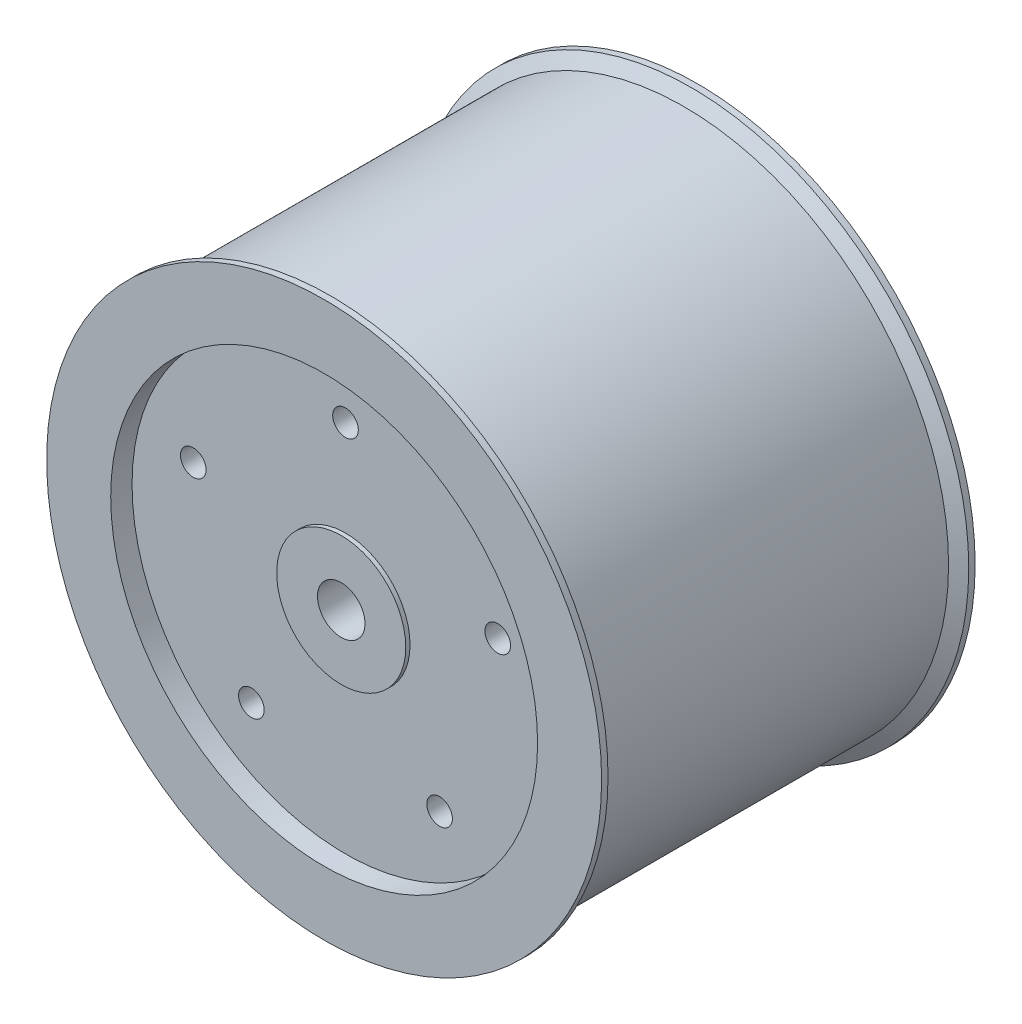
ISO-10303-21;
HEADER;
FILE_DESCRIPTION(('STEP AP214'),'2;1');
FILE_NAME('part.step','',(''),(''),'','','');
FILE_SCHEMA(('AUTOMOTIVE_DESIGN { 1 0 10303 214 1 1 1 1 }'));
ENDSEC;
DATA;
#1=APPLICATION_CONTEXT('core data for automotive mechanical design processes');
#2=APPLICATION_PROTOCOL_DEFINITION('international standard','automotive_design',2000,#1);
#3=PRODUCT_CONTEXT('',#1,'mechanical');
#4=PRODUCT('Part','Part','',(#3));
#5=PRODUCT_RELATED_PRODUCT_CATEGORY('part','',(#4));
#6=PRODUCT_DEFINITION_FORMATION('','',#4);
#7=PRODUCT_DEFINITION_CONTEXT('part definition',#1,'design');
#8=PRODUCT_DEFINITION('design','',#6,#7);
#9=PRODUCT_DEFINITION_SHAPE('','',#8);
#10=(LENGTH_UNIT() NAMED_UNIT(*) SI_UNIT(.MILLI.,.METRE.));
#11=(NAMED_UNIT(*) PLANE_ANGLE_UNIT() SI_UNIT($,.RADIAN.));
#12=(NAMED_UNIT(*) SI_UNIT($,.STERADIAN.) SOLID_ANGLE_UNIT());
#13=UNCERTAINTY_MEASURE_WITH_UNIT(LENGTH_MEASURE(1.E-05),#10,'distance_accuracy_value','');
#14=(GEOMETRIC_REPRESENTATION_CONTEXT(3) GLOBAL_UNCERTAINTY_ASSIGNED_CONTEXT((#13)) GLOBAL_UNIT_ASSIGNED_CONTEXT((#10,
#11,#12)) REPRESENTATION_CONTEXT('',''));
#15=CARTESIAN_POINT('',(0.,0.,0.));
#16=DIRECTION('',(0.,0.,1.));
#17=DIRECTION('',(1.,0.,0.));
#18=AXIS2_PLACEMENT_3D('',#15,#16,#17);
#19=CARTESIAN_POINT('',(0.,0.,87.5));
#20=DIRECTION('',(0.,0.,-1.));
#21=DIRECTION('',(-1.,0.,0.));
#22=AXIS2_PLACEMENT_3D('',#19,#20,#21);
#23=CYLINDRICAL_SURFACE('',#22,130.);
#24=CARTESIAN_POINT('',(0.,0.,-84.5));
#25=DIRECTION('',(0.,0.,1.));
#26=DIRECTION('',(1.,0.,0.));
#27=AXIS2_PLACEMENT_3D('',#24,#25,#26);
#28=CIRCLE('',#27,130.);
#29=CARTESIAN_POINT('',(130.,0.,-84.5));
#30=VERTEX_POINT('',#29);
#31=EDGE_CURVE('E144',#30,#30,#28,.T.);
#32=ORIENTED_EDGE('',*,*,#31,.F.);
#33=EDGE_LOOP('',(#32));
#34=FACE_BOUND('',#33,.T.);
#35=CARTESIAN_POINT('',(0.,0.,-87.5));
#36=DIRECTION('',(0.,0.,1.));
#37=DIRECTION('',(1.,0.,0.));
#38=AXIS2_PLACEMENT_3D('',#35,#36,#37);
#39=CIRCLE('',#38,130.);
#40=CARTESIAN_POINT('',(130.,0.,-87.5));
#41=VERTEX_POINT('',#40);
#42=EDGE_CURVE('E44',#41,#41,#39,.T.);
#43=ORIENTED_EDGE('',*,*,#42,.T.);
#44=EDGE_LOOP('',(#43));
#45=FACE_BOUND('',#44,.T.);
#46=ADVANCED_FACE('F33',(#34,#45),#23,.T.);
#47=CARTESIAN_POINT('',(0.,0.,87.5));
#48=DIRECTION('',(0.,0.,-1.));
#49=DIRECTION('',(-1.,0.,0.));
#50=AXIS2_PLACEMENT_3D('',#47,#48,#49);
#51=CYLINDRICAL_SURFACE('',#50,11.1125);
#52=CARTESIAN_POINT('',(0.,0.,79.5));
#53=DIRECTION('',(0.,0.,1.));
#54=DIRECTION('',(1.,0.,0.));
#55=AXIS2_PLACEMENT_3D('',#52,#53,#54);
#56=CIRCLE('',#55,11.1125);
#57=CARTESIAN_POINT('',(11.1125,0.,79.5));
#58=VERTEX_POINT('',#57);
#59=EDGE_CURVE('E147',#58,#58,#56,.T.);
#60=ORIENTED_EDGE('',*,*,#59,.T.);
#61=EDGE_LOOP('',(#60));
#62=FACE_BOUND('',#61,.T.);
#63=CARTESIAN_POINT('',(0.,0.,-77.5));
#64=DIRECTION('',(0.,0.,-1.));
#65=DIRECTION('',(-1.,0.,0.));
#66=AXIS2_PLACEMENT_3D('',#63,#64,#65);
#67=CIRCLE('',#66,11.1125);
#68=CARTESIAN_POINT('',(-11.1125,0.,-77.5));
#69=VERTEX_POINT('',#68);
#70=EDGE_CURVE('E55',#69,#69,#67,.T.);
#71=ORIENTED_EDGE('',*,*,#70,.T.);
#72=EDGE_LOOP('',(#71));
#73=FACE_BOUND('',#72,.T.);
#74=ADVANCED_FACE('F108',(#62,#73),#51,.F.);
#75=CARTESIAN_POINT('',(0.,0.,87.5));
#76=DIRECTION('',(0.,0.,1.));
#77=DIRECTION('',(1.,0.,0.));
#78=AXIS2_PLACEMENT_3D('',#75,#76,#77);
#79=PLANE('',#78);
#80=CARTESIAN_POINT('',(0.,0.,87.5));
#81=DIRECTION('',(0.,0.,1.));
#82=DIRECTION('',(1.,0.,0.));
#83=AXIS2_PLACEMENT_3D('',#80,#81,#82);
#84=CIRCLE('',#83,100.);
#85=CARTESIAN_POINT('',(100.,0.,87.5));
#86=VERTEX_POINT('',#85);
#87=EDGE_CURVE('E52',#86,#86,#84,.T.);
#88=ORIENTED_EDGE('',*,*,#87,.F.);
#89=EDGE_LOOP('',(#88));
#90=FACE_BOUND('',#89,.T.);
#91=CARTESIAN_POINT('',(0.,0.,87.5));
#92=DIRECTION('',(0.,0.,1.));
#93=DIRECTION('',(1.,0.,0.));
#94=AXIS2_PLACEMENT_3D('',#91,#92,#93);
#95=CIRCLE('',#94,130.);
#96=CARTESIAN_POINT('',(130.,0.,87.5));
#97=VERTEX_POINT('',#96);
#98=EDGE_CURVE('E40',#97,#97,#95,.T.);
#99=ORIENTED_EDGE('',*,*,#98,.T.);
#100=EDGE_LOOP('',(#99));
#101=FACE_BOUND('',#100,.T.);
#102=ADVANCED_FACE('F105',(#90,#101),#79,.T.);
#103=CARTESIAN_POINT('',(0.,0.,-87.5));
#104=DIRECTION('',(0.,0.,1.));
#105=DIRECTION('',(1.,0.,0.));
#106=AXIS2_PLACEMENT_3D('',#103,#104,#105);
#107=PLANE('',#106);
#108=CARTESIAN_POINT('',(0.,0.,-87.5));
#109=DIRECTION('',(0.,0.,1.));
#110=DIRECTION('',(1.,0.,0.));
#111=AXIS2_PLACEMENT_3D('',#108,#109,#110);
#112=CIRCLE('',#111,100.);
#113=CARTESIAN_POINT('',(100.,0.,-87.5));
#114=VERTEX_POINT('',#113);
#115=EDGE_CURVE('E93',#114,#114,#112,.T.);
#116=ORIENTED_EDGE('',*,*,#115,.T.);
#117=EDGE_LOOP('',(#116));
#118=FACE_BOUND('',#117,.T.);
#119=ORIENTED_EDGE('',*,*,#42,.F.);
#120=EDGE_LOOP('',(#119));
#121=FACE_BOUND('',#120,.T.);
#122=ADVANCED_FACE('F107',(#118,#121),#107,.F.);
#123=CARTESIAN_POINT('',(0.,0.,84.5));
#124=DIRECTION('',(0.,0.,1.));
#125=DIRECTION('',(1.,0.,0.));
#126=AXIS2_PLACEMENT_3D('',#123,#124,#125);
#127=CIRCLE('',#126,130.);
#128=CARTESIAN_POINT('',(130.,0.,84.5));
#129=VERTEX_POINT('',#128);
#130=EDGE_CURVE('E134',#129,#129,#127,.T.);
#131=ORIENTED_EDGE('',*,*,#130,.T.);
#132=EDGE_LOOP('',(#131));
#133=FACE_BOUND('',#132,.T.);
#134=ORIENTED_EDGE('',*,*,#98,.F.);
#135=EDGE_LOOP('',(#134));
#136=FACE_BOUND('',#135,.T.);
#137=ADVANCED_FACE('F35',(#133,#136),#23,.T.);
#138=CARTESIAN_POINT('',(0.,0.,77.5));
#139=DIRECTION('',(0.,0.,1.));
#140=DIRECTION('',(1.,0.,0.));
#141=AXIS2_PLACEMENT_3D('',#138,#139,#140);
#142=CYLINDRICAL_SURFACE('',#141,100.);
#143=CARTESIAN_POINT('',(0.,0.,77.5));
#144=DIRECTION('',(0.,0.,1.));
#145=DIRECTION('',(1.,0.,0.));
#146=AXIS2_PLACEMENT_3D('',#143,#144,#145);
#147=CIRCLE('',#146,100.);
#148=CARTESIAN_POINT('',(100.,0.,77.5));
#149=VERTEX_POINT('',#148);
#150=EDGE_CURVE('E49',#149,#149,#147,.T.);
#151=ORIENTED_EDGE('',*,*,#150,.F.);
#152=EDGE_LOOP('',(#151));
#153=FACE_BOUND('',#152,.T.);
#154=ORIENTED_EDGE('',*,*,#87,.T.);
#155=EDGE_LOOP('',(#154));
#156=FACE_BOUND('',#155,.T.);
#157=ADVANCED_FACE('F103',(#153,#156),#142,.F.);
#158=CARTESIAN_POINT('',(0.,0.,77.5));
#159=DIRECTION('',(0.,0.,1.));
#160=DIRECTION('',(1.,0.,0.));
#161=AXIS2_PLACEMENT_3D('',#158,#159,#160);
#162=PLANE('',#161);
#163=CARTESIAN_POINT('',(0.,0.,77.5));
#164=DIRECTION('',(0.,0.,1.));
#165=DIRECTION('',(1.,0.,0.));
#166=AXIS2_PLACEMENT_3D('',#163,#164,#165);
#167=CIRCLE('',#166,30.2387);
#168=CARTESIAN_POINT('',(30.2387,0.,77.5));
#169=VERTEX_POINT('',#168);
#170=EDGE_CURVE('E10',#169,#169,#167,.T.);
#171=ORIENTED_EDGE('',*,*,#170,.F.);
#172=EDGE_LOOP('',(#171));
#173=FACE_BOUND('',#172,.T.);
#174=CARTESIAN_POINT('',(-44.0838939219351,-60.6762745781213,77.5));
#175=DIRECTION('',(0.,0.,1.));
#176=DIRECTION('',(1.,0.,0.));
#177=AXIS2_PLACEMENT_3D('',#174,#175,#176);
#178=CIRCLE('',#177,6.);
#179=CARTESIAN_POINT('',(-38.0838939219351,-60.6762745781213,77.5));
#180=VERTEX_POINT('',#179);
#181=EDGE_CURVE('E67',#180,#180,#178,.T.);
#182=ORIENTED_EDGE('',*,*,#181,.F.);
#183=EDGE_LOOP('',(#182));
#184=FACE_BOUND('',#183,.T.);
#185=CARTESIAN_POINT('',(44.083893921936,-60.6762745781207,77.5));
#186=DIRECTION('',(0.,0.,1.));
#187=DIRECTION('',(1.,0.,0.));
#188=AXIS2_PLACEMENT_3D('',#185,#186,#187);
#189=CIRCLE('',#188,6.);
#190=CARTESIAN_POINT('',(50.083893921936,-60.6762745781207,77.5));
#191=VERTEX_POINT('',#190);
#192=EDGE_CURVE('E75',#191,#191,#189,.T.);
#193=ORIENTED_EDGE('',*,*,#192,.F.);
#194=EDGE_LOOP('',(#193));
#195=FACE_BOUND('',#194,.T.);
#196=CARTESIAN_POINT('',(71.3292387221363,23.1762745781219,77.5));
#197=DIRECTION('',(0.,0.,1.));
#198=DIRECTION('',(1.,0.,0.));
#199=AXIS2_PLACEMENT_3D('',#196,#197,#198);
#200=CIRCLE('',#199,6.);
#201=CARTESIAN_POINT('',(77.3292387221363,23.1762745781219,77.5));
#202=VERTEX_POINT('',#201);
#203=EDGE_CURVE('E71',#202,#202,#200,.T.);
#204=ORIENTED_EDGE('',*,*,#203,.F.);
#205=EDGE_LOOP('',(#204));
#206=FACE_BOUND('',#205,.T.);
#207=CARTESIAN_POINT('',(-71.3292387221366,23.1762745781209,77.5));
#208=DIRECTION('',(0.,0.,1.));
#209=DIRECTION('',(1.,0.,0.));
#210=AXIS2_PLACEMENT_3D('',#207,#208,#209);
#211=CIRCLE('',#210,6.);
#212=CARTESIAN_POINT('',(-65.3292387221366,23.1762745781209,77.5));
#213=VERTEX_POINT('',#212);
#214=EDGE_CURVE('E63',#213,#213,#211,.T.);
#215=ORIENTED_EDGE('',*,*,#214,.F.);
#216=EDGE_LOOP('',(#215));
#217=FACE_BOUND('',#216,.T.);
#218=CARTESIAN_POINT('',(0.,75.,77.5));
#219=DIRECTION('',(0.,0.,1.));
#220=DIRECTION('',(1.,0.,0.));
#221=AXIS2_PLACEMENT_3D('',#218,#219,#220);
#222=CIRCLE('',#221,6.);
#223=CARTESIAN_POINT('',(6.,75.,77.5));
#224=VERTEX_POINT('',#223);
#225=EDGE_CURVE('E62',#224,#224,#222,.T.);
#226=ORIENTED_EDGE('',*,*,#225,.F.);
#227=EDGE_LOOP('',(#226));
#228=FACE_BOUND('',#227,.T.);
#229=ORIENTED_EDGE('',*,*,#150,.T.);
#230=EDGE_LOOP('',(#229));
#231=FACE_BOUND('',#230,.T.);
#232=ADVANCED_FACE('F128',(#173,#184,#195,#206,#217,#228,#231),#162,.T.);
#233=CARTESIAN_POINT('',(0.,0.,-77.5));
#234=DIRECTION('',(0.,0.,-1.));
#235=DIRECTION('',(-1.,0.,0.));
#236=AXIS2_PLACEMENT_3D('',#233,#234,#235);
#237=CYLINDRICAL_SURFACE('',#236,100.);
#238=CARTESIAN_POINT('',(0.,0.,-77.5));
#239=DIRECTION('',(0.,0.,1.));
#240=DIRECTION('',(1.,0.,0.));
#241=AXIS2_PLACEMENT_3D('',#238,#239,#240);
#242=CIRCLE('',#241,100.);
#243=CARTESIAN_POINT('',(100.,0.,-77.5));
#244=VERTEX_POINT('',#243);
#245=EDGE_CURVE('E58',#244,#244,#242,.T.);
#246=ORIENTED_EDGE('',*,*,#245,.T.);
#247=EDGE_LOOP('',(#246));
#248=FACE_BOUND('',#247,.T.);
#249=ORIENTED_EDGE('',*,*,#115,.F.);
#250=EDGE_LOOP('',(#249));
#251=FACE_BOUND('',#250,.T.);
#252=ADVANCED_FACE('F187',(#248,#251),#237,.F.);
#253=CARTESIAN_POINT('',(0.,0.,-77.5));
#254=DIRECTION('',(0.,0.,-1.));
#255=DIRECTION('',(1.,0.,0.));
#256=AXIS2_PLACEMENT_3D('',#253,#254,#255);
#257=PLANE('',#256);
#258=CARTESIAN_POINT('',(-44.0838939219351,-60.6762745781213,-77.5));
#259=DIRECTION('',(0.,0.,-1.));
#260=DIRECTION('',(-1.,0.,0.));
#261=AXIS2_PLACEMENT_3D('',#258,#259,#260);
#262=CIRCLE('',#261,6.);
#263=CARTESIAN_POINT('',(-50.0838939219352,-60.6762745781213,-77.5));
#264=VERTEX_POINT('',#263);
#265=EDGE_CURVE('E76',#264,#264,#262,.T.);
#266=ORIENTED_EDGE('',*,*,#265,.F.);
#267=EDGE_LOOP('',(#266));
#268=FACE_BOUND('',#267,.T.);
#269=CARTESIAN_POINT('',(44.083893921936,-60.6762745781207,-77.5));
#270=DIRECTION('',(0.,0.,-1.));
#271=DIRECTION('',(-1.,0.,0.));
#272=AXIS2_PLACEMENT_3D('',#269,#270,#271);
#273=CIRCLE('',#272,6.);
#274=CARTESIAN_POINT('',(38.083893921936,-60.6762745781207,-77.5));
#275=VERTEX_POINT('',#274);
#276=EDGE_CURVE('E73',#275,#275,#273,.T.);
#277=ORIENTED_EDGE('',*,*,#276,.F.);
#278=EDGE_LOOP('',(#277));
#279=FACE_BOUND('',#278,.T.);
#280=CARTESIAN_POINT('',(71.3292387221363,23.1762745781219,-77.5));
#281=DIRECTION('',(0.,0.,-1.));
#282=DIRECTION('',(-1.,0.,0.));
#283=AXIS2_PLACEMENT_3D('',#280,#281,#282);
#284=CIRCLE('',#283,6.);
#285=CARTESIAN_POINT('',(65.3292387221363,23.1762745781219,-77.5));
#286=VERTEX_POINT('',#285);
#287=EDGE_CURVE('E68',#286,#286,#284,.T.);
#288=ORIENTED_EDGE('',*,*,#287,.F.);
#289=EDGE_LOOP('',(#288));
#290=FACE_BOUND('',#289,.T.);
#291=CARTESIAN_POINT('',(-71.3292387221366,23.1762745781209,-77.5));
#292=DIRECTION('',(0.,0.,-1.));
#293=DIRECTION('',(-1.,0.,0.));
#294=AXIS2_PLACEMENT_3D('',#291,#292,#293);
#295=CIRCLE('',#294,6.);
#296=CARTESIAN_POINT('',(-77.3292387221366,23.1762745781209,-77.5));
#297=VERTEX_POINT('',#296);
#298=EDGE_CURVE('E64',#297,#297,#295,.T.);
#299=ORIENTED_EDGE('',*,*,#298,.F.);
#300=EDGE_LOOP('',(#299));
#301=FACE_BOUND('',#300,.T.);
#302=CARTESIAN_POINT('',(0.,75.,-77.5));
#303=DIRECTION('',(0.,0.,-1.));
#304=DIRECTION('',(-1.,0.,0.));
#305=AXIS2_PLACEMENT_3D('',#302,#303,#304);
#306=CIRCLE('',#305,6.);
#307=CARTESIAN_POINT('',(-6.,75.,-77.5));
#308=VERTEX_POINT('',#307);
#309=EDGE_CURVE('E59',#308,#308,#306,.T.);
#310=ORIENTED_EDGE('',*,*,#309,.F.);
#311=EDGE_LOOP('',(#310));
#312=FACE_BOUND('',#311,.T.);
#313=ORIENTED_EDGE('',*,*,#70,.F.);
#314=EDGE_LOOP('',(#313));
#315=FACE_BOUND('',#314,.T.);
#316=ORIENTED_EDGE('',*,*,#245,.F.);
#317=EDGE_LOOP('',(#316));
#318=FACE_BOUND('',#317,.T.);
#319=ADVANCED_FACE('F183',(#268,#279,#290,#301,#312,#315,#318),#257,.T.);
#320=CARTESIAN_POINT('',(0.,75.,-87.5));
#321=DIRECTION('',(0.,0.,1.));
#322=DIRECTION('',(1.,0.,0.));
#323=AXIS2_PLACEMENT_3D('',#320,#321,#322);
#324=CYLINDRICAL_SURFACE('',#323,6.);
#325=ORIENTED_EDGE('',*,*,#225,.T.);
#326=EDGE_LOOP('',(#325));
#327=FACE_BOUND('',#326,.T.);
#328=ORIENTED_EDGE('',*,*,#309,.T.);
#329=EDGE_LOOP('',(#328));
#330=FACE_BOUND('',#329,.T.);
#331=ADVANCED_FACE('F179',(#327,#330),#324,.F.);
#332=CARTESIAN_POINT('',(-71.3292387221366,23.1762745781209,-87.5));
#333=DIRECTION('',(0.,0.,1.));
#334=DIRECTION('',(1.,0.,0.));
#335=AXIS2_PLACEMENT_3D('',#332,#333,#334);
#336=CYLINDRICAL_SURFACE('',#335,6.);
#337=ORIENTED_EDGE('',*,*,#214,.T.);
#338=EDGE_LOOP('',(#337));
#339=FACE_BOUND('',#338,.T.);
#340=ORIENTED_EDGE('',*,*,#298,.T.);
#341=EDGE_LOOP('',(#340));
#342=FACE_BOUND('',#341,.T.);
#343=ADVANCED_FACE('F175',(#339,#342),#336,.F.);
#344=CARTESIAN_POINT('',(71.3292387221363,23.1762745781219,-87.5));
#345=DIRECTION('',(0.,0.,1.));
#346=DIRECTION('',(1.,0.,0.));
#347=AXIS2_PLACEMENT_3D('',#344,#345,#346);
#348=CYLINDRICAL_SURFACE('',#347,6.);
#349=ORIENTED_EDGE('',*,*,#203,.T.);
#350=EDGE_LOOP('',(#349));
#351=FACE_BOUND('',#350,.T.);
#352=ORIENTED_EDGE('',*,*,#287,.T.);
#353=EDGE_LOOP('',(#352));
#354=FACE_BOUND('',#353,.T.);
#355=ADVANCED_FACE('F172',(#351,#354),#348,.F.);
#356=CARTESIAN_POINT('',(44.083893921936,-60.6762745781207,-87.5));
#357=DIRECTION('',(0.,0.,1.));
#358=DIRECTION('',(1.,0.,0.));
#359=AXIS2_PLACEMENT_3D('',#356,#357,#358);
#360=CYLINDRICAL_SURFACE('',#359,6.);
#361=ORIENTED_EDGE('',*,*,#192,.T.);
#362=EDGE_LOOP('',(#361));
#363=FACE_BOUND('',#362,.T.);
#364=ORIENTED_EDGE('',*,*,#276,.T.);
#365=EDGE_LOOP('',(#364));
#366=FACE_BOUND('',#365,.T.);
#367=ADVANCED_FACE('F165',(#363,#366),#360,.F.);
#368=CARTESIAN_POINT('',(-44.0838939219351,-60.6762745781213,-87.5));
#369=DIRECTION('',(0.,0.,1.));
#370=DIRECTION('',(1.,0.,0.));
#371=AXIS2_PLACEMENT_3D('',#368,#369,#370);
#372=CYLINDRICAL_SURFACE('',#371,6.);
#373=ORIENTED_EDGE('',*,*,#181,.T.);
#374=EDGE_LOOP('',(#373));
#375=FACE_BOUND('',#374,.T.);
#376=ORIENTED_EDGE('',*,*,#265,.T.);
#377=EDGE_LOOP('',(#376));
#378=FACE_BOUND('',#377,.T.);
#379=ADVANCED_FACE('F157',(#375,#378),#372,.F.);
#380=CARTESIAN_POINT('',(0.,0.,70.5));
#381=DIRECTION('',(0.,0.,1.));
#382=DIRECTION('',(1.,0.,0.));
#383=AXIS2_PLACEMENT_3D('',#380,#381,#382);
#384=CYLINDRICAL_SURFACE('',#383,30.2387);
#385=ORIENTED_EDGE('',*,*,#170,.T.);
#386=EDGE_LOOP('',(#385));
#387=FACE_BOUND('',#386,.T.);
#388=CARTESIAN_POINT('',(0.,0.,79.5));
#389=DIRECTION('',(0.,0.,1.));
#390=DIRECTION('',(1.,0.,0.));
#391=AXIS2_PLACEMENT_3D('',#388,#389,#390);
#392=CIRCLE('',#391,30.2387);
#393=CARTESIAN_POINT('',(30.2387,0.,79.5));
#394=VERTEX_POINT('',#393);
#395=EDGE_CURVE('E72',#394,#394,#392,.T.);
#396=ORIENTED_EDGE('',*,*,#395,.F.);
#397=EDGE_LOOP('',(#396));
#398=FACE_BOUND('',#397,.T.);
#399=ADVANCED_FACE('F155',(#387,#398),#384,.T.);
#400=CARTESIAN_POINT('',(0.,0.,79.5));
#401=DIRECTION('',(0.,0.,1.));
#402=DIRECTION('',(1.,0.,0.));
#403=AXIS2_PLACEMENT_3D('',#400,#401,#402);
#404=PLANE('',#403);
#405=ORIENTED_EDGE('',*,*,#395,.T.);
#406=EDGE_LOOP('',(#405));
#407=FACE_BOUND('',#406,.T.);
#408=ORIENTED_EDGE('',*,*,#59,.F.);
#409=EDGE_LOOP('',(#408));
#410=FACE_BOUND('',#409,.T.);
#411=ADVANCED_FACE('F152',(#407,#410),#404,.T.);
#412=CARTESIAN_POINT('',(0.,0.,-84.5));
#413=DIRECTION('',(0.,0.,-1.));
#414=DIRECTION('',(-1.,0.,0.));
#415=AXIS2_PLACEMENT_3D('',#412,#413,#414);
#416=CONICAL_SURFACE('',#415,130.,1.04719755119659);
#417=CARTESIAN_POINT('',(0.,0.,-81.0358983848622));
#418=DIRECTION('',(0.,0.,1.));
#419=DIRECTION('',(1.,0.,0.));
#420=AXIS2_PLACEMENT_3D('',#417,#418,#419);
#421=CIRCLE('',#420,124.);
#422=CARTESIAN_POINT('',(124.,0.,-81.0358983848622));
#423=VERTEX_POINT('',#422);
#424=EDGE_CURVE('E139',#423,#423,#421,.T.);
#425=ORIENTED_EDGE('',*,*,#424,.F.);
#426=EDGE_LOOP('',(#425));
#427=FACE_BOUND('',#426,.T.);
#428=ORIENTED_EDGE('',*,*,#31,.T.);
#429=EDGE_LOOP('',(#428));
#430=FACE_BOUND('',#429,.T.);
#431=ADVANCED_FACE('F163',(#427,#430),#416,.T.);
#432=CARTESIAN_POINT('',(0.,0.,0.));
#433=DIRECTION('',(0.,0.,1.));
#434=DIRECTION('',(1.,0.,0.));
#435=AXIS2_PLACEMENT_3D('',#432,#433,#434);
#436=CYLINDRICAL_SURFACE('',#435,124.);
#437=CARTESIAN_POINT('',(0.,0.,81.0358983848622));
#438=DIRECTION('',(0.,0.,1.));
#439=DIRECTION('',(1.,0.,0.));
#440=AXIS2_PLACEMENT_3D('',#437,#438,#439);
#441=CIRCLE('',#440,124.);
#442=CARTESIAN_POINT('',(124.,0.,81.0358983848622));
#443=VERTEX_POINT('',#442);
#444=EDGE_CURVE('E136',#443,#443,#441,.T.);
#445=ORIENTED_EDGE('',*,*,#444,.F.);
#446=EDGE_LOOP('',(#445));
#447=FACE_BOUND('',#446,.T.);
#448=ORIENTED_EDGE('',*,*,#424,.T.);
#449=EDGE_LOOP('',(#448));
#450=FACE_BOUND('',#449,.T.);
#451=ADVANCED_FACE('F291',(#447,#450),#436,.T.);
#452=CARTESIAN_POINT('',(0.,0.,81.0358983848622));
#453=DIRECTION('',(0.,0.,1.));
#454=DIRECTION('',(1.,0.,0.));
#455=AXIS2_PLACEMENT_3D('',#452,#453,#454);
#456=CONICAL_SURFACE('',#455,124.,1.04719755119659);
#457=ORIENTED_EDGE('',*,*,#130,.F.);
#458=EDGE_LOOP('',(#457));
#459=FACE_BOUND('',#458,.T.);
#460=ORIENTED_EDGE('',*,*,#444,.T.);
#461=EDGE_LOOP('',(#460));
#462=FACE_BOUND('',#461,.T.);
#463=ADVANCED_FACE('F299',(#459,#462),#456,.T.);
#464=CLOSED_SHELL('',(#46,#74,#102,#122,#137,#157,#232,#252,#319,#331,#343,#355,#367,#379,#399,
#411,#431,#451,#463));
#465=MANIFOLD_SOLID_BREP('B2',#464);
#466=ADVANCED_BREP_SHAPE_REPRESENTATION('',(#18,#465),#14);
#467=SHAPE_DEFINITION_REPRESENTATION(#9,#466);
ENDSEC;
END-ISO-10303-21;
